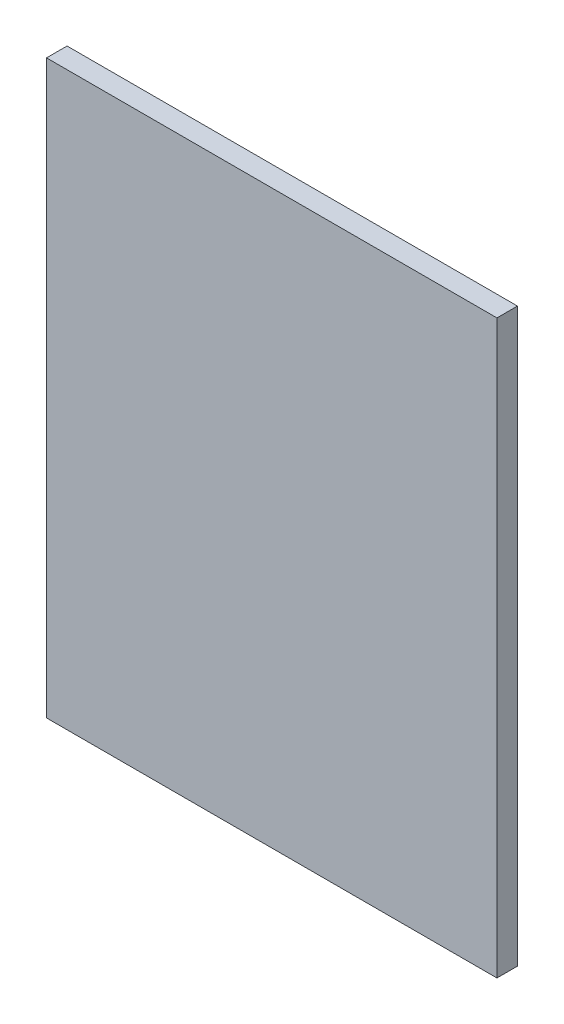
ISO-10303-21;
HEADER;
FILE_DESCRIPTION(('STEP AP214'),'2;1');
FILE_NAME('part.step','',(''),(''),'','','');
FILE_SCHEMA(('AUTOMOTIVE_DESIGN { 1 0 10303 214 1 1 1 1 }'));
ENDSEC;
DATA;
#1=APPLICATION_CONTEXT('core data for automotive mechanical design processes');
#2=APPLICATION_PROTOCOL_DEFINITION('international standard','automotive_design',2000,#1);
#3=PRODUCT_CONTEXT('',#1,'mechanical');
#4=PRODUCT('Part','Part','',(#3));
#5=PRODUCT_RELATED_PRODUCT_CATEGORY('part','',(#4));
#6=PRODUCT_DEFINITION_FORMATION('','',#4);
#7=PRODUCT_DEFINITION_CONTEXT('part definition',#1,'design');
#8=PRODUCT_DEFINITION('design','',#6,#7);
#9=PRODUCT_DEFINITION_SHAPE('','',#8);
#10=(LENGTH_UNIT() NAMED_UNIT(*) SI_UNIT(.MILLI.,.METRE.));
#11=(NAMED_UNIT(*) PLANE_ANGLE_UNIT() SI_UNIT($,.RADIAN.));
#12=(NAMED_UNIT(*) SI_UNIT($,.STERADIAN.) SOLID_ANGLE_UNIT());
#13=UNCERTAINTY_MEASURE_WITH_UNIT(LENGTH_MEASURE(1.E-05),#10,'distance_accuracy_value','');
#14=(GEOMETRIC_REPRESENTATION_CONTEXT(3) GLOBAL_UNCERTAINTY_ASSIGNED_CONTEXT((#13)) GLOBAL_UNIT_ASSIGNED_CONTEXT((#10,
#11,#12)) REPRESENTATION_CONTEXT('',''));
#15=CARTESIAN_POINT('',(0.,0.,0.));
#16=DIRECTION('',(0.,0.,1.));
#17=DIRECTION('',(1.,0.,0.));
#18=AXIS2_PLACEMENT_3D('',#15,#16,#17);
#19=CARTESIAN_POINT('',(97.1269989013672,88.181999206543,0.));
#20=DIRECTION('',(1.,0.,0.));
#21=DIRECTION('',(0.,-1.,0.));
#22=AXIS2_PLACEMENT_3D('',#19,#20,#21);
#23=PLANE('',#22);
#24=DIRECTION('',(0.,-1.,0.));
#25=VECTOR('',#24,1.);
#26=CARTESIAN_POINT('',(97.1269989013672,88.181999206543,0.03556));
#27=LINE('',#26,#25);
#28=CARTESIAN_POINT('',(97.1269989013672,88.181999206543,0.03556));
#29=VERTEX_POINT('',#28);
#30=CARTESIAN_POINT('',(97.1269989013672,87.1920013427734,0.03556));
#31=VERTEX_POINT('',#30);
#32=EDGE_CURVE('E11',#29,#31,#27,.T.);
#33=ORIENTED_EDGE('',*,*,#32,.F.);
#34=DIRECTION('',(0.,0.,1.));
#35=VECTOR('',#34,1.);
#36=CARTESIAN_POINT('',(97.1269989013672,88.181999206543,0.));
#37=LINE('',#36,#35);
#38=CARTESIAN_POINT('',(97.1269989013672,88.181999206543,0.));
#39=VERTEX_POINT('',#38);
#40=EDGE_CURVE('E24',#39,#29,#37,.T.);
#41=ORIENTED_EDGE('',*,*,#40,.F.);
#42=DIRECTION('',(0.,-1.,0.));
#43=VECTOR('',#42,1.);
#44=CARTESIAN_POINT('',(97.1269989013672,88.181999206543,0.));
#45=LINE('',#44,#43);
#46=CARTESIAN_POINT('',(97.1269989013672,87.1920013427734,0.));
#47=VERTEX_POINT('',#46);
#48=EDGE_CURVE('E75',#39,#47,#45,.T.);
#49=ORIENTED_EDGE('',*,*,#48,.T.);
#50=DIRECTION('',(0.,0.,1.));
#51=VECTOR('',#50,1.);
#52=CARTESIAN_POINT('',(97.1269989013672,87.1920013427734,0.));
#53=LINE('',#52,#51);
#54=EDGE_CURVE('E37',#47,#31,#53,.T.);
#55=ORIENTED_EDGE('',*,*,#54,.T.);
#56=EDGE_LOOP('',(#33,#41,#49,#55));
#57=FACE_BOUND('',#56,.T.);
#58=ADVANCED_FACE('F17',(#57),#23,.F.);
#59=CARTESIAN_POINT('',(97.1269989013672,87.1920013427734,0.));
#60=DIRECTION('',(0.,1.,0.));
#61=DIRECTION('',(1.,0.,0.));
#62=AXIS2_PLACEMENT_3D('',#59,#60,#61);
#63=PLANE('',#62);
#64=DIRECTION('',(1.,0.,0.));
#65=VECTOR('',#64,1.);
#66=CARTESIAN_POINT('',(97.1269989013672,87.1920013427734,0.03556));
#67=LINE('',#66,#65);
#68=CARTESIAN_POINT('',(97.9069976806641,87.1920013427734,0.03556));
#69=VERTEX_POINT('',#68);
#70=EDGE_CURVE('E83',#31,#69,#67,.T.);
#71=ORIENTED_EDGE('',*,*,#70,.F.);
#72=ORIENTED_EDGE('',*,*,#54,.F.);
#73=DIRECTION('',(1.,0.,0.));
#74=VECTOR('',#73,1.);
#75=CARTESIAN_POINT('',(97.1269989013672,87.1920013427734,0.));
#76=LINE('',#75,#74);
#77=CARTESIAN_POINT('',(97.9069976806641,87.1920013427734,0.));
#78=VERTEX_POINT('',#77);
#79=EDGE_CURVE('E81',#47,#78,#76,.T.);
#80=ORIENTED_EDGE('',*,*,#79,.T.);
#81=DIRECTION('',(0.,0.,1.));
#82=VECTOR('',#81,1.);
#83=CARTESIAN_POINT('',(97.9069976806641,87.1920013427734,0.));
#84=LINE('',#83,#82);
#85=EDGE_CURVE('E67',#78,#69,#84,.T.);
#86=ORIENTED_EDGE('',*,*,#85,.T.);
#87=EDGE_LOOP('',(#71,#72,#80,#86));
#88=FACE_BOUND('',#87,.T.);
#89=ADVANCED_FACE('F89',(#88),#63,.F.);
#90=CARTESIAN_POINT('',(97.9069976806641,87.1920013427734,0.));
#91=DIRECTION('',(-1.,0.,0.));
#92=DIRECTION('',(0.,1.,0.));
#93=AXIS2_PLACEMENT_3D('',#90,#91,#92);
#94=PLANE('',#93);
#95=DIRECTION('',(0.,1.,0.));
#96=VECTOR('',#95,1.);
#97=CARTESIAN_POINT('',(97.9069976806641,87.1920013427734,0.03556));
#98=LINE('',#97,#96);
#99=CARTESIAN_POINT('',(97.9069976806641,88.181999206543,0.03556));
#100=VERTEX_POINT('',#99);
#101=EDGE_CURVE('E71',#69,#100,#98,.T.);
#102=ORIENTED_EDGE('',*,*,#101,.F.);
#103=ORIENTED_EDGE('',*,*,#85,.F.);
#104=DIRECTION('',(0.,1.,0.));
#105=VECTOR('',#104,1.);
#106=CARTESIAN_POINT('',(97.9069976806641,87.1920013427734,0.));
#107=LINE('',#106,#105);
#108=CARTESIAN_POINT('',(97.9069976806641,88.181999206543,0.));
#109=VERTEX_POINT('',#108);
#110=EDGE_CURVE('E63',#78,#109,#107,.T.);
#111=ORIENTED_EDGE('',*,*,#110,.T.);
#112=DIRECTION('',(0.,0.,1.));
#113=VECTOR('',#112,1.);
#114=CARTESIAN_POINT('',(97.9069976806641,88.181999206543,0.));
#115=LINE('',#114,#113);
#116=EDGE_CURVE('E53',#109,#100,#115,.T.);
#117=ORIENTED_EDGE('',*,*,#116,.T.);
#118=EDGE_LOOP('',(#102,#103,#111,#117));
#119=FACE_BOUND('',#118,.T.);
#120=ADVANCED_FACE('F66',(#119),#94,.F.);
#121=CARTESIAN_POINT('',(97.9069976806641,88.181999206543,0.));
#122=DIRECTION('',(0.,-1.,0.));
#123=DIRECTION('',(-1.,0.,0.));
#124=AXIS2_PLACEMENT_3D('',#121,#122,#123);
#125=PLANE('',#124);
#126=DIRECTION('',(-1.,0.,0.));
#127=VECTOR('',#126,1.);
#128=CARTESIAN_POINT('',(97.9069976806641,88.181999206543,0.03556));
#129=LINE('',#128,#127);
#130=EDGE_CURVE('E59',#100,#29,#129,.T.);
#131=ORIENTED_EDGE('',*,*,#130,.F.);
#132=ORIENTED_EDGE('',*,*,#116,.F.);
#133=DIRECTION('',(-1.,0.,0.));
#134=VECTOR('',#133,1.);
#135=CARTESIAN_POINT('',(97.9069976806641,88.181999206543,0.));
#136=LINE('',#135,#134);
#137=EDGE_CURVE('E57',#109,#39,#136,.T.);
#138=ORIENTED_EDGE('',*,*,#137,.T.);
#139=ORIENTED_EDGE('',*,*,#40,.T.);
#140=EDGE_LOOP('',(#131,#132,#138,#139));
#141=FACE_BOUND('',#140,.T.);
#142=ADVANCED_FACE('F55',(#141),#125,.F.);
#143=CARTESIAN_POINT('',(97.1269989013672,88.181999206543,0.));
#144=DIRECTION('',(0.,0.,-1.));
#145=DIRECTION('',(-1.,0.,0.));
#146=AXIS2_PLACEMENT_3D('',#143,#144,#145);
#147=PLANE('',#146);
#148=ORIENTED_EDGE('',*,*,#137,.F.);
#149=ORIENTED_EDGE('',*,*,#110,.F.);
#150=ORIENTED_EDGE('',*,*,#79,.F.);
#151=ORIENTED_EDGE('',*,*,#48,.F.);
#152=EDGE_LOOP('',(#148,#149,#150,#151));
#153=FACE_BOUND('',#152,.T.);
#154=ADVANCED_FACE('F74',(#153),#147,.T.);
#155=CARTESIAN_POINT('',(97.1269989013672,88.181999206543,0.03556));
#156=DIRECTION('',(0.,0.,-1.));
#157=DIRECTION('',(-1.,0.,0.));
#158=AXIS2_PLACEMENT_3D('',#155,#156,#157);
#159=PLANE('',#158);
#160=ORIENTED_EDGE('',*,*,#32,.T.);
#161=ORIENTED_EDGE('',*,*,#70,.T.);
#162=ORIENTED_EDGE('',*,*,#101,.T.);
#163=ORIENTED_EDGE('',*,*,#130,.T.);
#164=EDGE_LOOP('',(#160,#161,#162,#163));
#165=FACE_BOUND('',#164,.T.);
#166=ADVANCED_FACE('F91',(#165),#159,.F.);
#167=CLOSED_SHELL('',(#58,#89,#120,#142,#154,#166));
#168=MANIFOLD_SOLID_BREP('B1',#167);
#169=ADVANCED_BREP_SHAPE_REPRESENTATION('',(#18,#168),#14);
#170=SHAPE_DEFINITION_REPRESENTATION(#9,#169);
ENDSEC;
END-ISO-10303-21;
